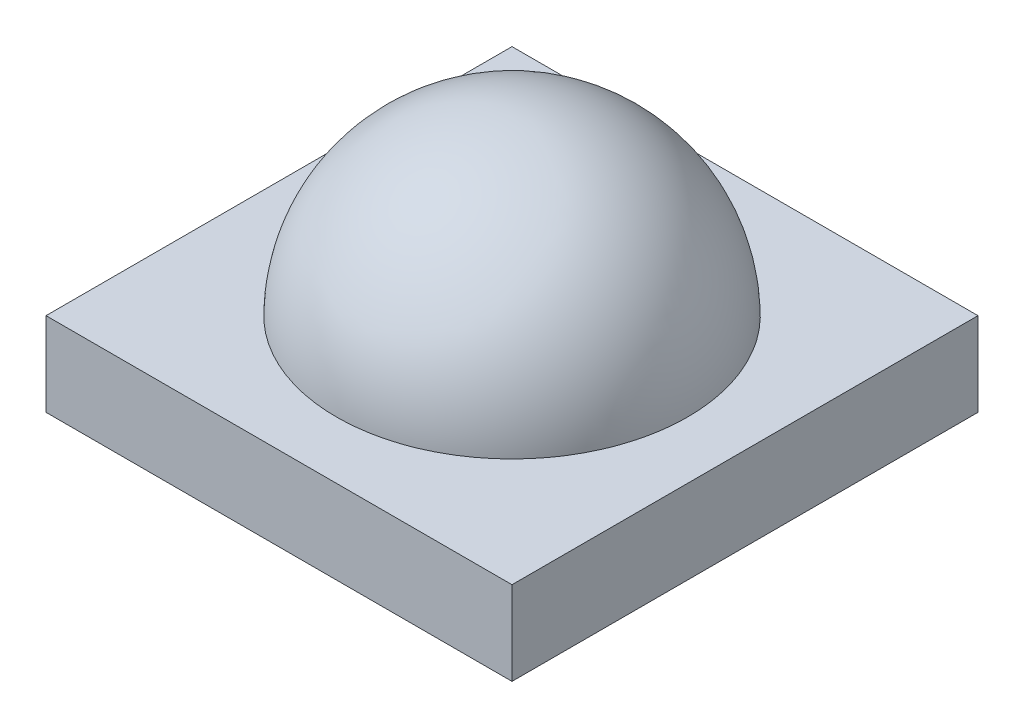
ISO-10303-21;
HEADER;
FILE_DESCRIPTION(('STEP AP214'),'2;1');
FILE_NAME('part.step','',(''),(''),'','','');
FILE_SCHEMA(('AUTOMOTIVE_DESIGN { 1 0 10303 214 1 1 1 1 }'));
ENDSEC;
DATA;
#1=APPLICATION_CONTEXT('core data for automotive mechanical design processes');
#2=APPLICATION_PROTOCOL_DEFINITION('international standard','automotive_design',2000,#1);
#3=PRODUCT_CONTEXT('',#1,'mechanical');
#4=PRODUCT('Part','Part','',(#3));
#5=PRODUCT_RELATED_PRODUCT_CATEGORY('part','',(#4));
#6=PRODUCT_DEFINITION_FORMATION('','',#4);
#7=PRODUCT_DEFINITION_CONTEXT('part definition',#1,'design');
#8=PRODUCT_DEFINITION('design','',#6,#7);
#9=PRODUCT_DEFINITION_SHAPE('','',#8);
#10=(LENGTH_UNIT() NAMED_UNIT(*) SI_UNIT(.MILLI.,.METRE.));
#11=(NAMED_UNIT(*) PLANE_ANGLE_UNIT() SI_UNIT($,.RADIAN.));
#12=(NAMED_UNIT(*) SI_UNIT($,.STERADIAN.) SOLID_ANGLE_UNIT());
#13=UNCERTAINTY_MEASURE_WITH_UNIT(LENGTH_MEASURE(1.E-05),#10,'distance_accuracy_value','');
#14=(GEOMETRIC_REPRESENTATION_CONTEXT(3) GLOBAL_UNCERTAINTY_ASSIGNED_CONTEXT((#13)) GLOBAL_UNIT_ASSIGNED_CONTEXT((#10,
#11,#12)) REPRESENTATION_CONTEXT('',''));
#15=CARTESIAN_POINT('',(0.,0.,0.));
#16=DIRECTION('',(0.,0.,1.));
#17=DIRECTION('',(1.,0.,0.));
#18=AXIS2_PLACEMENT_3D('',#15,#16,#17);
#19=CARTESIAN_POINT('',(2.54,0.6,0.));
#20=DIRECTION('',(-1.,0.,0.));
#21=DIRECTION('',(0.,1.,0.));
#22=AXIS2_PLACEMENT_3D('',#19,#20,#21);
#23=SPHERICAL_SURFACE('',#22,1.3);
#24=CARTESIAN_POINT('',(3.83984614474175,0.62,0.));
#25=CARTESIAN_POINT('',(3.83984655557343,0.62,-0.0133376037862006));
#26=CARTESIAN_POINT('',(3.83964114284594,0.62,-0.0266716627647828));
#27=CARTESIAN_POINT('',(3.83758495609044,0.62,-0.0934165811325725));
#28=CARTESIAN_POINT('',(3.83264387007009,0.62,-0.146765048220109));
#29=CARTESIAN_POINT('',(3.81320765311562,0.62,-0.271783256173086));
#30=CARTESIAN_POINT('',(3.79588384153375,0.62,-0.34303384707391));
#31=CARTESIAN_POINT('',(3.76114273193864,0.62,-0.446937577743441));
#32=CARTESIAN_POINT('',(3.74808459547026,0.62,-0.481111499095582));
#33=CARTESIAN_POINT('',(3.71912488551279,0.62,-0.548272245651136));
#34=CARTESIAN_POINT('',(3.70322068620494,0.62,-0.581257940529096));
#35=CARTESIAN_POINT('',(3.65146348916196,0.62,-0.677921630357325));
#36=CARTESIAN_POINT('',(3.61151388530399,0.62,-0.73946121597336));
#37=CARTESIAN_POINT('',(3.52183790804712,0.62,-0.854949776450851));
#38=CARTESIAN_POINT('',(3.47211146347502,0.62,-0.908898696049052));
#39=CARTESIAN_POINT('',(3.39130438934842,0.62,-0.98296580449178));
#40=CARTESIAN_POINT('',(3.36331181395965,0.62,-1.00652548538735));
#41=CARTESIAN_POINT('',(3.30547170229357,0.62,-1.05118366292618));
#42=CARTESIAN_POINT('',(3.27562597090515,0.62,-1.07228449847793));
#43=CARTESIAN_POINT('',(3.18355181470092,0.62,-1.13171015499637));
#44=CARTESIAN_POINT('',(3.11876802655875,0.62,-1.16617495919287));
#45=CARTESIAN_POINT('',(2.98436896210293,0.62,-1.2237184907284));
#46=CARTESIAN_POINT('',(2.91475383849276,0.62,-1.24679757774772));
#47=CARTESIAN_POINT('',(2.77262878139365,0.62,-1.28094575438073));
#48=CARTESIAN_POINT('',(2.70011887422256,0.62,-1.29201495315628));
#49=CARTESIAN_POINT('',(2.55427189667387,0.62,-1.30182156039609));
#50=CARTESIAN_POINT('',(2.48093482229732,0.62,-1.30055890921629));
#51=CARTESIAN_POINT('',(2.3355129720429,0.62,-1.28573964951476));
#52=CARTESIAN_POINT('',(2.2634281954341,0.62,-1.2721830481688));
#53=CARTESIAN_POINT('',(2.12255798444406,0.62,-1.23316020525569));
#54=CARTESIAN_POINT('',(2.05377254656807,0.62,-1.2076939763038));
#55=CARTESIAN_POINT('',(1.92145315724329,0.62,-1.14557476195844));
#56=CARTESIAN_POINT('',(1.85791921998544,0.62,-1.10892174633655));
#57=CARTESIAN_POINT('',(1.73790633574147,0.62,-1.02546955306683));
#58=CARTESIAN_POINT('',(1.68142742793487,0.62,-0.97867031907678));
#59=CARTESIAN_POINT('',(1.57712889894981,0.62,-0.876253653943748));
#60=CARTESIAN_POINT('',(1.52930915821094,0.62,-0.820636344575167));
#61=CARTESIAN_POINT('',(1.44368709572069,0.62,-0.702168703344013));
#62=CARTESIAN_POINT('',(1.40588449114724,0.62,-0.639318575763432));
#63=CARTESIAN_POINT('',(1.34136405320703,0.62,-0.508144123247066));
#64=CARTESIAN_POINT('',(1.31464699911199,0.619999999999999,-0.439819413871818));
#65=CARTESIAN_POINT('',(1.27605606309184,0.62,-0.309786277359226));
#66=CARTESIAN_POINT('',(1.26260007476469,0.62,-0.248539505287499));
#67=CARTESIAN_POINT('',(1.2446597002265,0.62,-0.124834016630756));
#68=CARTESIAN_POINT('',(1.24015577666462,0.619999999999998,-0.0623782403249561));
#69=CARTESIAN_POINT('',(1.24015344442657,0.619999999999999,0.0133376037862086));
#70=CARTESIAN_POINT('',(1.24035885715406,0.62,0.0266716627647871));
#71=CARTESIAN_POINT('',(1.24241504390956,0.620000000000001,0.0934165811325739));
#72=CARTESIAN_POINT('',(1.24735612992991,0.62,0.146765048220111));
#73=CARTESIAN_POINT('',(1.26679234688438,0.62,0.271783256173089));
#74=CARTESIAN_POINT('',(1.28411615846625,0.62,0.343033847073913));
#75=CARTESIAN_POINT('',(1.31885726806137,0.62,0.446937577743445));
#76=CARTESIAN_POINT('',(1.33191540452975,0.62,0.481111499095585));
#77=CARTESIAN_POINT('',(1.36087511448721,0.62,0.548272245651139));
#78=CARTESIAN_POINT('',(1.37677931379506,0.62,0.581257940529099));
#79=CARTESIAN_POINT('',(1.42853651083804,0.62,0.677921630357328));
#80=CARTESIAN_POINT('',(1.46848611469602,0.62,0.739461215973363));
#81=CARTESIAN_POINT('',(1.55816209195288,0.62,0.854949776450854));
#82=CARTESIAN_POINT('',(1.60788853652498,0.62,0.908898696049054));
#83=CARTESIAN_POINT('',(1.68869561065158,0.62,0.982965804491782));
#84=CARTESIAN_POINT('',(1.71668818604035,0.62,1.00652548538735));
#85=CARTESIAN_POINT('',(1.77452829770643,0.62,1.05118366292618));
#86=CARTESIAN_POINT('',(1.80437402909486,0.62,1.07228449847794));
#87=CARTESIAN_POINT('',(1.89644818529908,0.62,1.13171015499637));
#88=CARTESIAN_POINT('',(1.96123197344125,0.62,1.16617495919287));
#89=CARTESIAN_POINT('',(2.09563103789707,0.62,1.2237184907284));
#90=CARTESIAN_POINT('',(2.16524616150724,0.62,1.24679757774772));
#91=CARTESIAN_POINT('',(2.30737121860636,0.62,1.28094575438073));
#92=CARTESIAN_POINT('',(2.37988112577744,0.62,1.29201495315628));
#93=CARTESIAN_POINT('',(2.52572810332613,0.62,1.30182156039609));
#94=CARTESIAN_POINT('',(2.59906517770268,0.62,1.30055890921629));
#95=CARTESIAN_POINT('',(2.74448702795711,0.62,1.28573964951476));
#96=CARTESIAN_POINT('',(2.8165718045659,0.62,1.2721830481688));
#97=CARTESIAN_POINT('',(2.95744201555595,0.62,1.23316020525569));
#98=CARTESIAN_POINT('',(3.02622745343193,0.62,1.20769397630379));
#99=CARTESIAN_POINT('',(3.15854684275672,0.62,1.14557476195844));
#100=CARTESIAN_POINT('',(3.22208078001457,0.620000000000001,1.10892174633655));
#101=CARTESIAN_POINT('',(3.34209366425853,0.620000000000001,1.02546955306683));
#102=CARTESIAN_POINT('',(3.39857257206513,0.62,0.978670319076778));
#103=CARTESIAN_POINT('',(3.5028711010502,0.62,0.876253653943745));
#104=CARTESIAN_POINT('',(3.55069084178906,0.62,0.820636344575165));
#105=CARTESIAN_POINT('',(3.63631290427932,0.62,0.70216870334401));
#106=CARTESIAN_POINT('',(3.67411550885276,0.62,0.639318575763428));
#107=CARTESIAN_POINT('',(3.73863594679298,0.62,0.508144123247063));
#108=CARTESIAN_POINT('',(3.76535300088801,0.619999999999999,0.439819413871814));
#109=CARTESIAN_POINT('',(3.80394393690816,0.62,0.309786277359225));
#110=CARTESIAN_POINT('',(3.8173999252353,0.62,0.2485395052875));
#111=CARTESIAN_POINT('',(3.83534029977349,0.62,0.124834016630762));
#112=CARTESIAN_POINT('',(3.83984422333537,0.62,0.062378240324965));
#113=CARTESIAN_POINT('',(3.83984614474175,0.62,0.));
#114=B_SPLINE_CURVE_WITH_KNOTS('',3,(#24,#25,#26,#27,#28,#29,#30,#31,#32,#33,#34,#35,#36,#37,
#38,#39,#40,#41,#42,#43,#44,#45,#46,#47,#48,#49,#50,#51,#52,#53,#54,#55,#56,#57,#58,#59,#60,#61,
#62,#63,#64,#65,#66,#67,#68,#69,#70,#71,#72,#73,#74,#75,#76,#77,#78,#79,#80,#81,#82,#83,#84,#85,
#86,#87,#88,#89,#90,#91,#92,#93,#94,#95,#96,#97,#98,#99,#100,#101,#102,#103,#104,#105,#106,#107,
#108,#109,#110,#111,#112,#113),.UNSPECIFIED.,.T.,.F.,(4,2,2,2,2,2,2,2,2,2,2,2,2,2,2,2,2,2,2,2,2,
2,2,2,2,2,2,2,2,2,2,2,2,2,2,2,2,2,2,2,2,2,2,2,4),(0.,0.0400063154493854,0.200317721174631,
0.419135523863878,0.528777526511949,0.638521212950158,0.857524471274162,1.07652932395191,
1.18617740857296,1.2957203270571,1.51473229700781,1.7337373478216,1.95274040800921,
2.17174452742446,2.39074851901066,2.60975227861776,2.8287566300121,3.04776219757458,
3.26676474101347,3.48576110051416,3.70477285201297,3.89228688205201,4.07939122250334,
4.11939753795271,4.27970894367796,4.49852674636721,4.60816874901528,4.71791243545349,
4.93691569377749,5.15592054645524,5.26556863107629,5.37511154956043,5.59412351951114,
5.81312857032493,6.03213163051254,6.25113574992779,6.47013974151399,6.6891435011211,
6.90814785251543,7.12715342007791,7.3461559635168,7.56515232301749,7.78416407451631,
7.97167810455533,8.15878244500665),.UNSPECIFIED.);
#115=CARTESIAN_POINT('',(3.83984614474175,0.62,0.));
#116=VERTEX_POINT('',#115);
#117=EDGE_CURVE('E22',#116,#116,#114,.T.);
#118=ORIENTED_EDGE('',*,*,#117,.T.);
#119=EDGE_LOOP('',(#118));
#120=FACE_BOUND('',#119,.T.);
#121=ADVANCED_FACE('F17',(#120),#23,.T.);
#122=CARTESIAN_POINT('',(0.,0.62,0.));
#123=DIRECTION('',(0.,-1.,0.));
#124=DIRECTION('',(0.,0.,-1.));
#125=AXIS2_PLACEMENT_3D('',#122,#123,#124);
#126=PLANE('',#125);
#127=DIRECTION('',(1.,0.,0.));
#128=VECTOR('',#127,1.);
#129=CARTESIAN_POINT('',(0.815,0.62,-1.725));
#130=LINE('',#129,#128);
#131=CARTESIAN_POINT('',(4.265,0.62,-1.725));
#132=VERTEX_POINT('',#131);
#133=CARTESIAN_POINT('',(0.815,0.62,-1.725));
#134=VERTEX_POINT('',#133);
#135=EDGE_CURVE('E89',#132,#134,#130,.F.);
#136=ORIENTED_EDGE('',*,*,#135,.T.);
#137=DIRECTION('',(0.,0.,-1.));
#138=VECTOR('',#137,1.);
#139=CARTESIAN_POINT('',(0.815,0.62,1.725));
#140=LINE('',#139,#138);
#141=CARTESIAN_POINT('',(0.815,0.62,1.725));
#142=VERTEX_POINT('',#141);
#143=EDGE_CURVE('E58',#134,#142,#140,.F.);
#144=ORIENTED_EDGE('',*,*,#143,.T.);
#145=DIRECTION('',(-1.,0.,0.));
#146=VECTOR('',#145,1.);
#147=CARTESIAN_POINT('',(0.815,0.62,1.725));
#148=LINE('',#147,#146);
#149=CARTESIAN_POINT('',(4.265,0.62,1.725));
#150=VERTEX_POINT('',#149);
#151=EDGE_CURVE('E60',#142,#150,#148,.F.);
#152=ORIENTED_EDGE('',*,*,#151,.T.);
#153=DIRECTION('',(0.,0.,1.));
#154=VECTOR('',#153,1.);
#155=CARTESIAN_POINT('',(4.265,0.62,1.725));
#156=LINE('',#155,#154);
#157=EDGE_CURVE('E64',#150,#132,#156,.F.);
#158=ORIENTED_EDGE('',*,*,#157,.T.);
#159=EDGE_LOOP('',(#136,#144,#152,#158));
#160=FACE_BOUND('',#159,.T.);
#161=ORIENTED_EDGE('',*,*,#117,.F.);
#162=EDGE_LOOP('',(#161));
#163=FACE_BOUND('',#162,.T.);
#164=ADVANCED_FACE('F62',(#160,#163),#126,.F.);
#165=CARTESIAN_POINT('',(4.265,0.62,1.725));
#166=DIRECTION('',(-1.,0.,0.));
#167=DIRECTION('',(0.,0.,1.));
#168=AXIS2_PLACEMENT_3D('',#165,#166,#167);
#169=PLANE('',#168);
#170=DIRECTION('',(0.,1.,0.));
#171=VECTOR('',#170,1.);
#172=CARTESIAN_POINT('',(4.265,0.62,-1.725));
#173=LINE('',#172,#171);
#174=CARTESIAN_POINT('',(4.265,0.,-1.725));
#175=VERTEX_POINT('',#174);
#176=EDGE_CURVE('E75',#175,#132,#173,.T.);
#177=ORIENTED_EDGE('',*,*,#176,.T.);
#178=ORIENTED_EDGE('',*,*,#157,.F.);
#179=DIRECTION('',(0.,1.,0.));
#180=VECTOR('',#179,1.);
#181=CARTESIAN_POINT('',(4.265,0.62,1.725));
#182=LINE('',#181,#180);
#183=CARTESIAN_POINT('',(4.265,0.,1.725));
#184=VERTEX_POINT('',#183);
#185=EDGE_CURVE('E69',#150,#184,#182,.F.);
#186=ORIENTED_EDGE('',*,*,#185,.T.);
#187=DIRECTION('',(0.,0.,-1.));
#188=VECTOR('',#187,1.);
#189=CARTESIAN_POINT('',(4.265,0.,0.));
#190=LINE('',#189,#188);
#191=EDGE_CURVE('E92',#175,#184,#190,.F.);
#192=ORIENTED_EDGE('',*,*,#191,.F.);
#193=EDGE_LOOP('',(#177,#178,#186,#192));
#194=FACE_BOUND('',#193,.T.);
#195=ADVANCED_FACE('F72',(#194),#169,.F.);
#196=CARTESIAN_POINT('',(0.815,0.62,1.725));
#197=DIRECTION('',(0.,0.,-1.));
#198=DIRECTION('',(-1.,0.,0.));
#199=AXIS2_PLACEMENT_3D('',#196,#197,#198);
#200=PLANE('',#199);
#201=ORIENTED_EDGE('',*,*,#185,.F.);
#202=ORIENTED_EDGE('',*,*,#151,.F.);
#203=DIRECTION('',(0.,1.,0.));
#204=VECTOR('',#203,1.);
#205=CARTESIAN_POINT('',(0.815,0.62,1.725));
#206=LINE('',#205,#204);
#207=CARTESIAN_POINT('',(0.815,0.,1.725));
#208=VERTEX_POINT('',#207);
#209=EDGE_CURVE('E83',#142,#208,#206,.F.);
#210=ORIENTED_EDGE('',*,*,#209,.T.);
#211=DIRECTION('',(1.,0.,0.));
#212=VECTOR('',#211,1.);
#213=CARTESIAN_POINT('',(0.,0.,1.725));
#214=LINE('',#213,#212);
#215=EDGE_CURVE('E80',#184,#208,#214,.F.);
#216=ORIENTED_EDGE('',*,*,#215,.F.);
#217=EDGE_LOOP('',(#201,#202,#210,#216));
#218=FACE_BOUND('',#217,.T.);
#219=ADVANCED_FACE('F78',(#218),#200,.F.);
#220=CARTESIAN_POINT('',(0.815,0.62,1.725));
#221=DIRECTION('',(1.,0.,0.));
#222=DIRECTION('',(0.,0.,-1.));
#223=AXIS2_PLACEMENT_3D('',#220,#221,#222);
#224=PLANE('',#223);
#225=ORIENTED_EDGE('',*,*,#209,.F.);
#226=ORIENTED_EDGE('',*,*,#143,.F.);
#227=DIRECTION('',(0.,1.,0.));
#228=VECTOR('',#227,1.);
#229=CARTESIAN_POINT('',(0.815,0.62,-1.725));
#230=LINE('',#229,#228);
#231=CARTESIAN_POINT('',(0.815,0.,-1.725));
#232=VERTEX_POINT('',#231);
#233=EDGE_CURVE('E38',#134,#232,#230,.F.);
#234=ORIENTED_EDGE('',*,*,#233,.T.);
#235=DIRECTION('',(0.,0.,-1.));
#236=VECTOR('',#235,1.);
#237=CARTESIAN_POINT('',(0.815,0.,0.));
#238=LINE('',#237,#236);
#239=EDGE_CURVE('E29',#208,#232,#238,.T.);
#240=ORIENTED_EDGE('',*,*,#239,.F.);
#241=EDGE_LOOP('',(#225,#226,#234,#240));
#242=FACE_BOUND('',#241,.T.);
#243=ADVANCED_FACE('F98',(#242),#224,.F.);
#244=CARTESIAN_POINT('',(0.815,0.62,-1.725));
#245=DIRECTION('',(0.,0.,1.));
#246=DIRECTION('',(1.,0.,0.));
#247=AXIS2_PLACEMENT_3D('',#244,#245,#246);
#248=PLANE('',#247);
#249=ORIENTED_EDGE('',*,*,#233,.F.);
#250=ORIENTED_EDGE('',*,*,#135,.F.);
#251=ORIENTED_EDGE('',*,*,#176,.F.);
#252=DIRECTION('',(1.,0.,0.));
#253=VECTOR('',#252,1.);
#254=CARTESIAN_POINT('',(0.,0.,-1.725));
#255=LINE('',#254,#253);
#256=EDGE_CURVE('E11',#232,#175,#255,.T.);
#257=ORIENTED_EDGE('',*,*,#256,.F.);
#258=EDGE_LOOP('',(#249,#250,#251,#257));
#259=FACE_BOUND('',#258,.T.);
#260=ADVANCED_FACE('F100',(#259),#248,.F.);
#261=CARTESIAN_POINT('',(0.,0.,0.));
#262=DIRECTION('',(0.,-1.,0.));
#263=DIRECTION('',(0.,0.,-1.));
#264=AXIS2_PLACEMENT_3D('',#261,#262,#263);
#265=PLANE('',#264);
#266=ORIENTED_EDGE('',*,*,#239,.T.);
#267=ORIENTED_EDGE('',*,*,#256,.T.);
#268=ORIENTED_EDGE('',*,*,#191,.T.);
#269=ORIENTED_EDGE('',*,*,#215,.T.);
#270=EDGE_LOOP('',(#266,#267,#268,#269));
#271=FACE_BOUND('',#270,.T.);
#272=ADVANCED_FACE('F97',(#271),#265,.T.);
#273=CLOSED_SHELL('',(#121,#164,#195,#219,#243,#260,#272));
#274=MANIFOLD_SOLID_BREP('B1',#273);
#275=ADVANCED_BREP_SHAPE_REPRESENTATION('',(#18,#274),#14);
#276=SHAPE_DEFINITION_REPRESENTATION(#9,#275);
ENDSEC;
END-ISO-10303-21;
